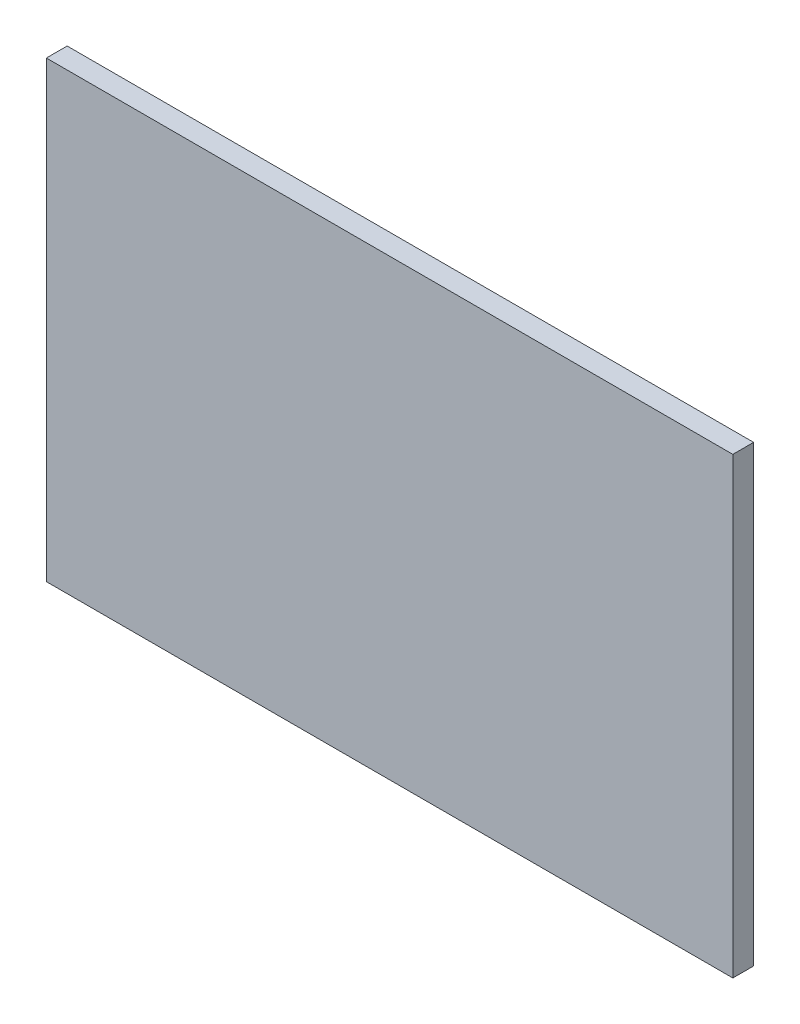
ISO-10303-21;
HEADER;
FILE_DESCRIPTION(('STEP AP214'),'2;1');
FILE_NAME('part.step','',(''),(''),'','','');
FILE_SCHEMA(('AUTOMOTIVE_DESIGN { 1 0 10303 214 1 1 1 1 }'));
ENDSEC;
DATA;
#1=APPLICATION_CONTEXT('core data for automotive mechanical design processes');
#2=APPLICATION_PROTOCOL_DEFINITION('international standard','automotive_design',2000,#1);
#3=PRODUCT_CONTEXT('',#1,'mechanical');
#4=PRODUCT('Part','Part','',(#3));
#5=PRODUCT_RELATED_PRODUCT_CATEGORY('part','',(#4));
#6=PRODUCT_DEFINITION_FORMATION('','',#4);
#7=PRODUCT_DEFINITION_CONTEXT('part definition',#1,'design');
#8=PRODUCT_DEFINITION('design','',#6,#7);
#9=PRODUCT_DEFINITION_SHAPE('','',#8);
#10=(LENGTH_UNIT() NAMED_UNIT(*) SI_UNIT(.MILLI.,.METRE.));
#11=(NAMED_UNIT(*) PLANE_ANGLE_UNIT() SI_UNIT($,.RADIAN.));
#12=(NAMED_UNIT(*) SI_UNIT($,.STERADIAN.) SOLID_ANGLE_UNIT());
#13=UNCERTAINTY_MEASURE_WITH_UNIT(LENGTH_MEASURE(1.E-05),#10,'distance_accuracy_value','');
#14=(GEOMETRIC_REPRESENTATION_CONTEXT(3) GLOBAL_UNCERTAINTY_ASSIGNED_CONTEXT((#13)) GLOBAL_UNIT_ASSIGNED_CONTEXT((#10,
#11,#12)) REPRESENTATION_CONTEXT('',''));
#15=CARTESIAN_POINT('',(0.,0.,0.));
#16=DIRECTION('',(0.,0.,1.));
#17=DIRECTION('',(1.,0.,0.));
#18=AXIS2_PLACEMENT_3D('',#15,#16,#17);
#19=CARTESIAN_POINT('',(82.5,54.5,5.));
#20=DIRECTION('',(-1.,0.,0.));
#21=DIRECTION('',(0.,0.,1.));
#22=AXIS2_PLACEMENT_3D('',#19,#20,#21);
#23=PLANE('',#22);
#24=DIRECTION('',(0.,1.,0.));
#25=VECTOR('',#24,1.);
#26=CARTESIAN_POINT('',(82.5,54.5,0.));
#27=LINE('',#26,#25);
#28=CARTESIAN_POINT('',(82.5,-54.5,0.));
#29=VERTEX_POINT('',#28);
#30=CARTESIAN_POINT('',(82.5,54.5,0.));
#31=VERTEX_POINT('',#30);
#32=EDGE_CURVE('E98',#29,#31,#27,.T.);
#33=ORIENTED_EDGE('',*,*,#32,.T.);
#34=DIRECTION('',(0.,0.,-1.));
#35=VECTOR('',#34,1.);
#36=CARTESIAN_POINT('',(82.5,54.5,5.));
#37=LINE('',#36,#35);
#38=CARTESIAN_POINT('',(82.5,54.5,5.));
#39=VERTEX_POINT('',#38);
#40=EDGE_CURVE('E11',#39,#31,#37,.T.);
#41=ORIENTED_EDGE('',*,*,#40,.F.);
#42=DIRECTION('',(0.,1.,0.));
#43=VECTOR('',#42,1.);
#44=CARTESIAN_POINT('',(82.5,54.5,5.));
#45=LINE('',#44,#43);
#46=CARTESIAN_POINT('',(82.5,-54.5,5.));
#47=VERTEX_POINT('',#46);
#48=EDGE_CURVE('E86',#47,#39,#45,.T.);
#49=ORIENTED_EDGE('',*,*,#48,.F.);
#50=DIRECTION('',(0.,0.,-1.));
#51=VECTOR('',#50,1.);
#52=CARTESIAN_POINT('',(82.5,-54.5,5.));
#53=LINE('',#52,#51);
#54=EDGE_CURVE('E94',#47,#29,#53,.T.);
#55=ORIENTED_EDGE('',*,*,#54,.T.);
#56=EDGE_LOOP('',(#33,#41,#49,#55));
#57=FACE_BOUND('',#56,.T.);
#58=ADVANCED_FACE('F35',(#57),#23,.F.);
#59=CARTESIAN_POINT('',(-82.5,54.5,5.));
#60=DIRECTION('',(0.,-1.,0.));
#61=DIRECTION('',(0.,0.,-1.));
#62=AXIS2_PLACEMENT_3D('',#59,#60,#61);
#63=PLANE('',#62);
#64=DIRECTION('',(-1.,0.,0.));
#65=VECTOR('',#64,1.);
#66=CARTESIAN_POINT('',(-82.5,54.5,0.));
#67=LINE('',#66,#65);
#68=CARTESIAN_POINT('',(-82.5,54.5,0.));
#69=VERTEX_POINT('',#68);
#70=EDGE_CURVE('E90',#31,#69,#67,.T.);
#71=ORIENTED_EDGE('',*,*,#70,.T.);
#72=DIRECTION('',(0.,0.,-1.));
#73=VECTOR('',#72,1.);
#74=CARTESIAN_POINT('',(-82.5,54.5,5.));
#75=LINE('',#74,#73);
#76=CARTESIAN_POINT('',(-82.5,54.5,5.));
#77=VERTEX_POINT('',#76);
#78=EDGE_CURVE('E43',#77,#69,#75,.T.);
#79=ORIENTED_EDGE('',*,*,#78,.F.);
#80=DIRECTION('',(-1.,0.,0.));
#81=VECTOR('',#80,1.);
#82=CARTESIAN_POINT('',(-82.5,54.5,5.));
#83=LINE('',#82,#81);
#84=EDGE_CURVE('E81',#39,#77,#83,.T.);
#85=ORIENTED_EDGE('',*,*,#84,.F.);
#86=ORIENTED_EDGE('',*,*,#40,.T.);
#87=EDGE_LOOP('',(#71,#79,#85,#86));
#88=FACE_BOUND('',#87,.T.);
#89=ADVANCED_FACE('F89',(#88),#63,.F.);
#90=CARTESIAN_POINT('',(-82.5,54.5,5.));
#91=DIRECTION('',(1.,0.,0.));
#92=DIRECTION('',(0.,1.,0.));
#93=AXIS2_PLACEMENT_3D('',#90,#91,#92);
#94=PLANE('',#93);
#95=DIRECTION('',(0.,-1.,0.));
#96=VECTOR('',#95,1.);
#97=CARTESIAN_POINT('',(-82.5,54.5,0.));
#98=LINE('',#97,#96);
#99=CARTESIAN_POINT('',(-82.5,-54.5,0.));
#100=VERTEX_POINT('',#99);
#101=EDGE_CURVE('E68',#69,#100,#98,.T.);
#102=ORIENTED_EDGE('',*,*,#101,.T.);
#103=DIRECTION('',(0.,0.,-1.));
#104=VECTOR('',#103,1.);
#105=CARTESIAN_POINT('',(-82.5,-54.5,5.));
#106=LINE('',#105,#104);
#107=CARTESIAN_POINT('',(-82.5,-54.5,5.));
#108=VERTEX_POINT('',#107);
#109=EDGE_CURVE('E91',#108,#100,#106,.T.);
#110=ORIENTED_EDGE('',*,*,#109,.F.);
#111=DIRECTION('',(0.,-1.,0.));
#112=VECTOR('',#111,1.);
#113=CARTESIAN_POINT('',(-82.5,54.5,5.));
#114=LINE('',#113,#112);
#115=EDGE_CURVE('E84',#77,#108,#114,.T.);
#116=ORIENTED_EDGE('',*,*,#115,.F.);
#117=ORIENTED_EDGE('',*,*,#78,.T.);
#118=EDGE_LOOP('',(#102,#110,#116,#117));
#119=FACE_BOUND('',#118,.T.);
#120=ADVANCED_FACE('F92',(#119),#94,.F.);
#121=CARTESIAN_POINT('',(-82.5,-54.5,5.));
#122=DIRECTION('',(0.,1.,0.));
#123=DIRECTION('',(0.,0.,1.));
#124=AXIS2_PLACEMENT_3D('',#121,#122,#123);
#125=PLANE('',#124);
#126=DIRECTION('',(1.,0.,0.));
#127=VECTOR('',#126,1.);
#128=CARTESIAN_POINT('',(-82.5,-54.5,0.));
#129=LINE('',#128,#127);
#130=EDGE_CURVE('E74',#100,#29,#129,.T.);
#131=ORIENTED_EDGE('',*,*,#130,.T.);
#132=ORIENTED_EDGE('',*,*,#54,.F.);
#133=DIRECTION('',(1.,0.,0.));
#134=VECTOR('',#133,1.);
#135=CARTESIAN_POINT('',(-82.5,-54.5,5.));
#136=LINE('',#135,#134);
#137=EDGE_CURVE('E51',#108,#47,#136,.T.);
#138=ORIENTED_EDGE('',*,*,#137,.F.);
#139=ORIENTED_EDGE('',*,*,#109,.T.);
#140=EDGE_LOOP('',(#131,#132,#138,#139));
#141=FACE_BOUND('',#140,.T.);
#142=ADVANCED_FACE('F105',(#141),#125,.F.);
#143=CARTESIAN_POINT('',(0.,0.,5.));
#144=DIRECTION('',(0.,0.,1.));
#145=DIRECTION('',(1.,0.,0.));
#146=AXIS2_PLACEMENT_3D('',#143,#144,#145);
#147=PLANE('',#146);
#148=ORIENTED_EDGE('',*,*,#48,.T.);
#149=ORIENTED_EDGE('',*,*,#84,.T.);
#150=ORIENTED_EDGE('',*,*,#115,.T.);
#151=ORIENTED_EDGE('',*,*,#137,.T.);
#152=EDGE_LOOP('',(#148,#149,#150,#151));
#153=FACE_BOUND('',#152,.T.);
#154=ADVANCED_FACE('F82',(#153),#147,.T.);
#155=CARTESIAN_POINT('',(0.,0.,0.));
#156=DIRECTION('',(0.,0.,1.));
#157=DIRECTION('',(1.,0.,0.));
#158=AXIS2_PLACEMENT_3D('',#155,#156,#157);
#159=PLANE('',#158);
#160=ORIENTED_EDGE('',*,*,#32,.F.);
#161=ORIENTED_EDGE('',*,*,#130,.F.);
#162=ORIENTED_EDGE('',*,*,#101,.F.);
#163=ORIENTED_EDGE('',*,*,#70,.F.);
#164=EDGE_LOOP('',(#160,#161,#162,#163));
#165=FACE_BOUND('',#164,.T.);
#166=ADVANCED_FACE('F108',(#165),#159,.F.);
#167=CLOSED_SHELL('',(#58,#89,#120,#142,#154,#166));
#168=MANIFOLD_SOLID_BREP('B2',#167);
#169=ADVANCED_BREP_SHAPE_REPRESENTATION('',(#18,#168),#14);
#170=SHAPE_DEFINITION_REPRESENTATION(#9,#169);
ENDSEC;
END-ISO-10303-21;
